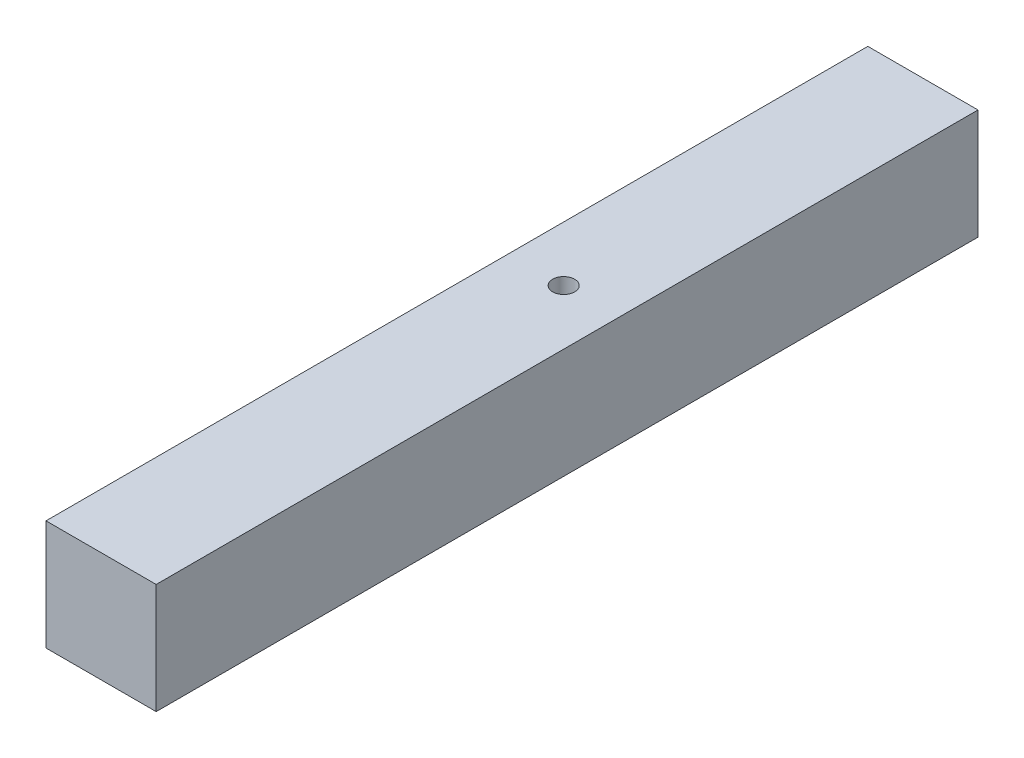
ISO-10303-21;
HEADER;
FILE_DESCRIPTION(('STEP AP214'),'2;1');
FILE_NAME('part.step','',(''),(''),'','','');
FILE_SCHEMA(('AUTOMOTIVE_DESIGN { 1 0 10303 214 1 1 1 1 }'));
ENDSEC;
DATA;
#1=APPLICATION_CONTEXT('core data for automotive mechanical design processes');
#2=APPLICATION_PROTOCOL_DEFINITION('international standard','automotive_design',2000,#1);
#3=PRODUCT_CONTEXT('',#1,'mechanical');
#4=PRODUCT('Part','Part','',(#3));
#5=PRODUCT_RELATED_PRODUCT_CATEGORY('part','',(#4));
#6=PRODUCT_DEFINITION_FORMATION('','',#4);
#7=PRODUCT_DEFINITION_CONTEXT('part definition',#1,'design');
#8=PRODUCT_DEFINITION('design','',#6,#7);
#9=PRODUCT_DEFINITION_SHAPE('','',#8);
#10=(LENGTH_UNIT() NAMED_UNIT(*) SI_UNIT(.MILLI.,.METRE.));
#11=(NAMED_UNIT(*) PLANE_ANGLE_UNIT() SI_UNIT($,.RADIAN.));
#12=(NAMED_UNIT(*) SI_UNIT($,.STERADIAN.) SOLID_ANGLE_UNIT());
#13=UNCERTAINTY_MEASURE_WITH_UNIT(LENGTH_MEASURE(1.E-05),#10,'distance_accuracy_value','');
#14=(GEOMETRIC_REPRESENTATION_CONTEXT(3) GLOBAL_UNCERTAINTY_ASSIGNED_CONTEXT((#13)) GLOBAL_UNIT_ASSIGNED_CONTEXT((#10,
#11,#12)) REPRESENTATION_CONTEXT('',''));
#15=CARTESIAN_POINT('',(0.,0.,0.));
#16=DIRECTION('',(0.,0.,1.));
#17=DIRECTION('',(1.,0.,0.));
#18=AXIS2_PLACEMENT_3D('',#15,#16,#17);
#19=CARTESIAN_POINT('',(0.,0.,149.19));
#20=DIRECTION('',(1.,0.,0.));
#21=DIRECTION('',(0.,0.,-1.));
#22=AXIS2_PLACEMENT_3D('',#19,#20,#21);
#23=PLANE('',#22);
#24=DIRECTION('',(0.,-1.,0.));
#25=VECTOR('',#24,1.);
#26=CARTESIAN_POINT('',(0.,0.,0.));
#27=LINE('',#26,#25);
#28=CARTESIAN_POINT('',(0.,20.,0.));
#29=VERTEX_POINT('',#28);
#30=CARTESIAN_POINT('',(0.,0.,0.));
#31=VERTEX_POINT('',#30);
#32=EDGE_CURVE('E102',#29,#31,#27,.T.);
#33=ORIENTED_EDGE('',*,*,#32,.T.);
#34=DIRECTION('',(0.,0.,-1.));
#35=VECTOR('',#34,1.);
#36=CARTESIAN_POINT('',(0.,0.,149.19));
#37=LINE('',#36,#35);
#38=CARTESIAN_POINT('',(0.,0.,149.19));
#39=VERTEX_POINT('',#38);
#40=EDGE_CURVE('E11',#39,#31,#37,.T.);
#41=ORIENTED_EDGE('',*,*,#40,.F.);
#42=DIRECTION('',(0.,-1.,0.));
#43=VECTOR('',#42,1.);
#44=CARTESIAN_POINT('',(0.,0.,149.19));
#45=LINE('',#44,#43);
#46=CARTESIAN_POINT('',(0.,20.,149.19));
#47=VERTEX_POINT('',#46);
#48=EDGE_CURVE('E90',#47,#39,#45,.T.);
#49=ORIENTED_EDGE('',*,*,#48,.F.);
#50=DIRECTION('',(0.,0.,-1.));
#51=VECTOR('',#50,1.);
#52=CARTESIAN_POINT('',(0.,20.,149.19));
#53=LINE('',#52,#51);
#54=EDGE_CURVE('E98',#47,#29,#53,.T.);
#55=ORIENTED_EDGE('',*,*,#54,.T.);
#56=EDGE_LOOP('',(#33,#41,#49,#55));
#57=FACE_BOUND('',#56,.T.);
#58=ADVANCED_FACE('F39',(#57),#23,.F.);
#59=CARTESIAN_POINT('',(0.,0.,149.19));
#60=DIRECTION('',(0.,1.,0.));
#61=DIRECTION('',(0.,0.,1.));
#62=AXIS2_PLACEMENT_3D('',#59,#60,#61);
#63=PLANE('',#62);
#64=CARTESIAN_POINT('',(10.,0.,65.2144740905128));
#65=DIRECTION('',(0.,1.,0.));
#66=DIRECTION('',(0.,0.,1.));
#67=AXIS2_PLACEMENT_3D('',#64,#65,#66);
#68=CIRCLE('',#67,2.);
#69=CARTESIAN_POINT('',(10.,0.,67.2144740905128));
#70=VERTEX_POINT('',#69);
#71=EDGE_CURVE('E105',#70,#70,#68,.T.);
#72=ORIENTED_EDGE('',*,*,#71,.T.);
#73=EDGE_LOOP('',(#72));
#74=FACE_BOUND('',#73,.T.);
#75=DIRECTION('',(1.,0.,0.));
#76=VECTOR('',#75,1.);
#77=CARTESIAN_POINT('',(0.,0.,0.));
#78=LINE('',#77,#76);
#79=CARTESIAN_POINT('',(20.,0.,0.));
#80=VERTEX_POINT('',#79);
#81=EDGE_CURVE('E94',#31,#80,#78,.T.);
#82=ORIENTED_EDGE('',*,*,#81,.T.);
#83=DIRECTION('',(0.,0.,-1.));
#84=VECTOR('',#83,1.);
#85=CARTESIAN_POINT('',(20.,0.,149.19));
#86=LINE('',#85,#84);
#87=CARTESIAN_POINT('',(20.,0.,149.19));
#88=VERTEX_POINT('',#87);
#89=EDGE_CURVE('E47',#88,#80,#86,.T.);
#90=ORIENTED_EDGE('',*,*,#89,.F.);
#91=DIRECTION('',(1.,0.,0.));
#92=VECTOR('',#91,1.);
#93=CARTESIAN_POINT('',(0.,0.,149.19));
#94=LINE('',#93,#92);
#95=EDGE_CURVE('E85',#39,#88,#94,.T.);
#96=ORIENTED_EDGE('',*,*,#95,.F.);
#97=ORIENTED_EDGE('',*,*,#40,.T.);
#98=EDGE_LOOP('',(#82,#90,#96,#97));
#99=FACE_BOUND('',#98,.T.);
#100=ADVANCED_FACE('F93',(#74,#99),#63,.F.);
#101=CARTESIAN_POINT('',(20.,0.,149.19));
#102=DIRECTION('',(-1.,0.,0.));
#103=DIRECTION('',(0.,0.,1.));
#104=AXIS2_PLACEMENT_3D('',#101,#102,#103);
#105=PLANE('',#104);
#106=DIRECTION('',(0.,1.,0.));
#107=VECTOR('',#106,1.);
#108=CARTESIAN_POINT('',(20.,0.,0.));
#109=LINE('',#108,#107);
#110=CARTESIAN_POINT('',(20.,20.,0.));
#111=VERTEX_POINT('',#110);
#112=EDGE_CURVE('E72',#80,#111,#109,.T.);
#113=ORIENTED_EDGE('',*,*,#112,.T.);
#114=DIRECTION('',(0.,0.,-1.));
#115=VECTOR('',#114,1.);
#116=CARTESIAN_POINT('',(20.,20.,149.19));
#117=LINE('',#116,#115);
#118=CARTESIAN_POINT('',(20.,20.,149.19));
#119=VERTEX_POINT('',#118);
#120=EDGE_CURVE('E95',#119,#111,#117,.T.);
#121=ORIENTED_EDGE('',*,*,#120,.F.);
#122=DIRECTION('',(0.,1.,0.));
#123=VECTOR('',#122,1.);
#124=CARTESIAN_POINT('',(20.,0.,149.19));
#125=LINE('',#124,#123);
#126=EDGE_CURVE('E88',#88,#119,#125,.T.);
#127=ORIENTED_EDGE('',*,*,#126,.F.);
#128=ORIENTED_EDGE('',*,*,#89,.T.);
#129=EDGE_LOOP('',(#113,#121,#127,#128));
#130=FACE_BOUND('',#129,.T.);
#131=ADVANCED_FACE('F96',(#130),#105,.F.);
#132=CARTESIAN_POINT('',(0.,20.,149.19));
#133=DIRECTION('',(0.,-1.,0.));
#134=DIRECTION('',(0.,0.,-1.));
#135=AXIS2_PLACEMENT_3D('',#132,#133,#134);
#136=PLANE('',#135);
#137=CARTESIAN_POINT('',(10.,20.,65.2144740905128));
#138=DIRECTION('',(0.,1.,0.));
#139=DIRECTION('',(0.,0.,1.));
#140=AXIS2_PLACEMENT_3D('',#137,#138,#139);
#141=CIRCLE('',#140,2.);
#142=CARTESIAN_POINT('',(10.,20.,67.2144740905128));
#143=VERTEX_POINT('',#142);
#144=EDGE_CURVE('E116',#143,#143,#141,.T.);
#145=ORIENTED_EDGE('',*,*,#144,.F.);
#146=EDGE_LOOP('',(#145));
#147=FACE_BOUND('',#146,.T.);
#148=DIRECTION('',(-1.,0.,0.));
#149=VECTOR('',#148,1.);
#150=CARTESIAN_POINT('',(0.,20.,0.));
#151=LINE('',#150,#149);
#152=EDGE_CURVE('E78',#111,#29,#151,.T.);
#153=ORIENTED_EDGE('',*,*,#152,.T.);
#154=ORIENTED_EDGE('',*,*,#54,.F.);
#155=DIRECTION('',(-1.,0.,0.));
#156=VECTOR('',#155,1.);
#157=CARTESIAN_POINT('',(0.,20.,149.19));
#158=LINE('',#157,#156);
#159=EDGE_CURVE('E55',#119,#47,#158,.T.);
#160=ORIENTED_EDGE('',*,*,#159,.F.);
#161=ORIENTED_EDGE('',*,*,#120,.T.);
#162=EDGE_LOOP('',(#153,#154,#160,#161));
#163=FACE_BOUND('',#162,.T.);
#164=ADVANCED_FACE('F110',(#147,#163),#136,.F.);
#165=CARTESIAN_POINT('',(0.,0.,149.19));
#166=DIRECTION('',(0.,0.,-1.));
#167=DIRECTION('',(-1.,0.,0.));
#168=AXIS2_PLACEMENT_3D('',#165,#166,#167);
#169=PLANE('',#168);
#170=ORIENTED_EDGE('',*,*,#48,.T.);
#171=ORIENTED_EDGE('',*,*,#95,.T.);
#172=ORIENTED_EDGE('',*,*,#126,.T.);
#173=ORIENTED_EDGE('',*,*,#159,.T.);
#174=EDGE_LOOP('',(#170,#171,#172,#173));
#175=FACE_BOUND('',#174,.T.);
#176=ADVANCED_FACE('F86',(#175),#169,.F.);
#177=CARTESIAN_POINT('',(0.,0.,0.));
#178=DIRECTION('',(0.,0.,-1.));
#179=DIRECTION('',(-1.,0.,0.));
#180=AXIS2_PLACEMENT_3D('',#177,#178,#179);
#181=PLANE('',#180);
#182=ORIENTED_EDGE('',*,*,#32,.F.);
#183=ORIENTED_EDGE('',*,*,#152,.F.);
#184=ORIENTED_EDGE('',*,*,#112,.F.);
#185=ORIENTED_EDGE('',*,*,#81,.F.);
#186=EDGE_LOOP('',(#182,#183,#184,#185));
#187=FACE_BOUND('',#186,.T.);
#188=ADVANCED_FACE('F113',(#187),#181,.T.);
#189=CARTESIAN_POINT('',(10.,0.,65.2144740905128));
#190=DIRECTION('',(0.,1.,0.));
#191=DIRECTION('',(0.,0.,1.));
#192=AXIS2_PLACEMENT_3D('',#189,#190,#191);
#193=CYLINDRICAL_SURFACE('',#192,2.);
#194=ORIENTED_EDGE('',*,*,#71,.F.);
#195=EDGE_LOOP('',(#194));
#196=FACE_BOUND('',#195,.T.);
#197=ORIENTED_EDGE('',*,*,#144,.T.);
#198=EDGE_LOOP('',(#197));
#199=FACE_BOUND('',#198,.T.);
#200=ADVANCED_FACE('F123',(#196,#199),#193,.F.);
#201=CLOSED_SHELL('',(#58,#100,#131,#164,#176,#188,#200));
#202=MANIFOLD_SOLID_BREP('B2',#201);
#203=ADVANCED_BREP_SHAPE_REPRESENTATION('',(#18,#202),#14);
#204=SHAPE_DEFINITION_REPRESENTATION(#9,#203);
ENDSEC;
END-ISO-10303-21;
